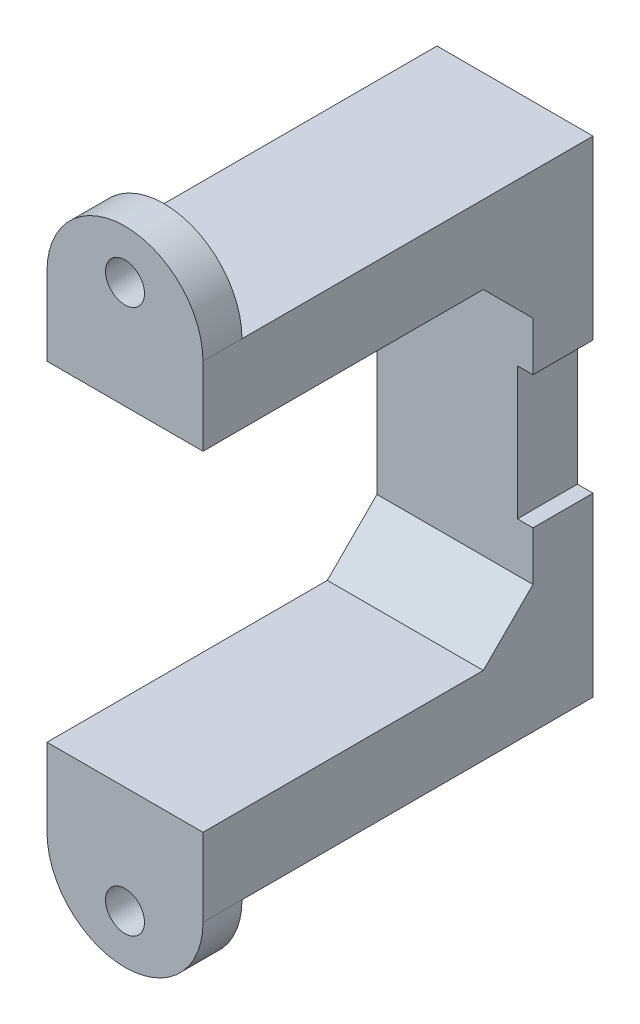
ISO-10303-21;
HEADER;
FILE_DESCRIPTION(('STEP AP214'),'2;1');
FILE_NAME('part.step','',(''),(''),'','','');
FILE_SCHEMA(('AUTOMOTIVE_DESIGN { 1 0 10303 214 1 1 1 1 }'));
ENDSEC;
DATA;
#1=APPLICATION_CONTEXT('core data for automotive mechanical design processes');
#2=APPLICATION_PROTOCOL_DEFINITION('international standard','automotive_design',2000,#1);
#3=PRODUCT_CONTEXT('',#1,'mechanical');
#4=PRODUCT('Part','Part','',(#3));
#5=PRODUCT_RELATED_PRODUCT_CATEGORY('part','',(#4));
#6=PRODUCT_DEFINITION_FORMATION('','',#4);
#7=PRODUCT_DEFINITION_CONTEXT('part definition',#1,'design');
#8=PRODUCT_DEFINITION('design','',#6,#7);
#9=PRODUCT_DEFINITION_SHAPE('','',#8);
#10=(LENGTH_UNIT() NAMED_UNIT(*) SI_UNIT(.MILLI.,.METRE.));
#11=(NAMED_UNIT(*) PLANE_ANGLE_UNIT() SI_UNIT($,.RADIAN.));
#12=(NAMED_UNIT(*) SI_UNIT($,.STERADIAN.) SOLID_ANGLE_UNIT());
#13=UNCERTAINTY_MEASURE_WITH_UNIT(LENGTH_MEASURE(1.E-05),#10,'distance_accuracy_value','');
#14=(GEOMETRIC_REPRESENTATION_CONTEXT(3) GLOBAL_UNCERTAINTY_ASSIGNED_CONTEXT((#13)) GLOBAL_UNIT_ASSIGNED_CONTEXT((#10,
#11,#12)) REPRESENTATION_CONTEXT('',''));
#15=CARTESIAN_POINT('',(0.,0.,0.));
#16=DIRECTION('',(0.,0.,1.));
#17=DIRECTION('',(1.,0.,0.));
#18=AXIS2_PLACEMENT_3D('',#15,#16,#17);
#19=CARTESIAN_POINT('',(0.,62.3,0.));
#20=DIRECTION('',(-1.,0.,0.));
#21=DIRECTION('',(0.,0.,1.));
#22=AXIS2_PLACEMENT_3D('',#19,#20,#21);
#23=PLANE('',#22);
#24=DIRECTION('',(0.,1.,0.));
#25=VECTOR('',#24,1.);
#26=CARTESIAN_POINT('',(0.,62.3,-42.3));
#27=LINE('',#26,#25);
#28=CARTESIAN_POINT('',(0.,39.65,-42.3));
#29=VERTEX_POINT('',#28);
#30=CARTESIAN_POINT('',(0.,45.936038969321,-42.3));
#31=VERTEX_POINT('',#30);
#32=EDGE_CURVE('E192',#29,#31,#27,.T.);
#33=ORIENTED_EDGE('',*,*,#32,.F.);
#34=DIRECTION('',(0.,0.,-1.));
#35=VECTOR('',#34,1.);
#36=CARTESIAN_POINT('',(0.,39.65,-40.));
#37=LINE('',#36,#35);
#38=CARTESIAN_POINT('',(0.,39.65,-50.));
#39=VERTEX_POINT('',#38);
#40=EDGE_CURVE('E352',#29,#39,#37,.T.);
#41=ORIENTED_EDGE('',*,*,#40,.T.);
#42=DIRECTION('',(0.,-1.,0.));
#43=VECTOR('',#42,1.);
#44=CARTESIAN_POINT('',(0.,62.3,-50.));
#45=LINE('',#44,#43);
#46=CARTESIAN_POINT('',(0.,62.3,-50.));
#47=VERTEX_POINT('',#46);
#48=EDGE_CURVE('E171',#47,#39,#45,.T.);
#49=ORIENTED_EDGE('',*,*,#48,.F.);
#50=DIRECTION('',(0.,0.,-1.));
#51=VECTOR('',#50,1.);
#52=CARTESIAN_POINT('',(0.,62.3,0.));
#53=LINE('',#52,#51);
#54=CARTESIAN_POINT('',(0.,62.3,-5.));
#55=VERTEX_POINT('',#54);
#56=EDGE_CURVE('E239',#55,#47,#53,.T.);
#57=ORIENTED_EDGE('',*,*,#56,.F.);
#58=CARTESIAN_POINT('',(0.,62.3,0.));
#59=VERTEX_POINT('',#58);
#60=EDGE_CURVE('E241',#59,#55,#53,.T.);
#61=ORIENTED_EDGE('',*,*,#60,.F.);
#62=DIRECTION('',(0.,-1.,0.));
#63=VECTOR('',#62,1.);
#64=CARTESIAN_POINT('',(0.,62.3,0.));
#65=LINE('',#64,#63);
#66=CARTESIAN_POINT('',(0.,52.3,0.));
#67=VERTEX_POINT('',#66);
#68=EDGE_CURVE('E180',#59,#67,#65,.T.);
#69=ORIENTED_EDGE('',*,*,#68,.T.);
#70=DIRECTION('',(0.,0.,1.));
#71=VECTOR('',#70,1.);
#72=CARTESIAN_POINT('',(0.,52.3,0.));
#73=LINE('',#72,#71);
#74=CARTESIAN_POINT('',(0.,52.3,-35.9360389693211));
#75=VERTEX_POINT('',#74);
#76=EDGE_CURVE('E198',#75,#67,#73,.T.);
#77=ORIENTED_EDGE('',*,*,#76,.F.);
#78=DIRECTION('',(0.,-0.707106781186551,-0.707106781186544));
#79=VECTOR('',#78,1.);
#80=CARTESIAN_POINT('',(0.,75.2680194846606,-12.9680194846607));
#81=LINE('',#80,#79);
#82=EDGE_CURVE('E195',#75,#31,#81,.T.);
#83=ORIENTED_EDGE('',*,*,#82,.T.);
#84=EDGE_LOOP('',(#33,#41,#49,#57,#61,#69,#77,#83));
#85=FACE_BOUND('',#84,.T.);
#86=ADVANCED_FACE('F33',(#85),#23,.F.);
#87=CARTESIAN_POINT('',(0.,62.3,0.));
#88=DIRECTION('',(0.,1.,0.));
#89=DIRECTION('',(0.,0.,1.));
#90=AXIS2_PLACEMENT_3D('',#87,#88,#89);
#91=PLANE('',#90);
#92=DIRECTION('',(0.,0.,1.));
#93=VECTOR('',#92,1.);
#94=CARTESIAN_POINT('',(-20.,62.3,0.));
#95=LINE('',#94,#93);
#96=CARTESIAN_POINT('',(-20.,62.3,-50.));
#97=VERTEX_POINT('',#96);
#98=CARTESIAN_POINT('',(-20.,62.3,-5.));
#99=VERTEX_POINT('',#98);
#100=EDGE_CURVE('E237',#97,#99,#95,.T.);
#101=ORIENTED_EDGE('',*,*,#100,.T.);
#102=DIRECTION('',(1.,0.,0.));
#103=VECTOR('',#102,1.);
#104=CARTESIAN_POINT('',(-20.,62.3,-5.));
#105=LINE('',#104,#103);
#106=EDGE_CURVE('E56',#99,#55,#105,.T.);
#107=ORIENTED_EDGE('',*,*,#106,.T.);
#108=ORIENTED_EDGE('',*,*,#56,.T.);
#109=DIRECTION('',(-1.,0.,0.));
#110=VECTOR('',#109,1.);
#111=CARTESIAN_POINT('',(0.,62.3,-50.));
#112=LINE('',#111,#110);
#113=EDGE_CURVE('E176',#47,#97,#112,.T.);
#114=ORIENTED_EDGE('',*,*,#113,.T.);
#115=EDGE_LOOP('',(#101,#107,#108,#114));
#116=FACE_BOUND('',#115,.T.);
#117=ADVANCED_FACE('F321',(#116),#91,.T.);
#118=CARTESIAN_POINT('',(-20.,62.3,0.));
#119=DIRECTION('',(1.,0.,0.));
#120=DIRECTION('',(0.,0.,-1.));
#121=AXIS2_PLACEMENT_3D('',#118,#119,#120);
#122=PLANE('',#121);
#123=DIRECTION('',(0.,0.,-1.));
#124=VECTOR('',#123,1.);
#125=CARTESIAN_POINT('',(-20.,52.3,0.));
#126=LINE('',#125,#124);
#127=CARTESIAN_POINT('',(-20.,52.3,0.));
#128=VERTEX_POINT('',#127);
#129=CARTESIAN_POINT('',(-20.,52.3,-35.9360389693211));
#130=VERTEX_POINT('',#129);
#131=EDGE_CURVE('E282',#128,#130,#126,.T.);
#132=ORIENTED_EDGE('',*,*,#131,.F.);
#133=DIRECTION('',(0.,-1.,0.));
#134=VECTOR('',#133,1.);
#135=CARTESIAN_POINT('',(-20.,62.3,0.));
#136=LINE('',#135,#134);
#137=CARTESIAN_POINT('',(-20.,62.3,0.));
#138=VERTEX_POINT('',#137);
#139=EDGE_CURVE('E184',#138,#128,#136,.T.);
#140=ORIENTED_EDGE('',*,*,#139,.F.);
#141=DIRECTION('',(0.,0.,1.));
#142=VECTOR('',#141,1.);
#143=CARTESIAN_POINT('',(-20.,62.3,-5.));
#144=LINE('',#143,#142);
#145=EDGE_CURVE('E277',#99,#138,#144,.T.);
#146=ORIENTED_EDGE('',*,*,#145,.F.);
#147=ORIENTED_EDGE('',*,*,#100,.F.);
#148=DIRECTION('',(0.,-1.,0.));
#149=VECTOR('',#148,1.);
#150=CARTESIAN_POINT('',(-20.,62.3,-50.));
#151=LINE('',#150,#149);
#152=CARTESIAN_POINT('',(-20.,0.,-50.));
#153=VERTEX_POINT('',#152);
#154=EDGE_CURVE('E172',#97,#153,#151,.T.);
#155=ORIENTED_EDGE('',*,*,#154,.T.);
#156=DIRECTION('',(0.,0.,1.));
#157=VECTOR('',#156,1.);
#158=CARTESIAN_POINT('',(-20.,0.,0.));
#159=LINE('',#158,#157);
#160=CARTESIAN_POINT('',(-20.,0.,-5.));
#161=VERTEX_POINT('',#160);
#162=EDGE_CURVE('E236',#153,#161,#159,.T.);
#163=ORIENTED_EDGE('',*,*,#162,.T.);
#164=DIRECTION('',(0.,0.,1.));
#165=VECTOR('',#164,1.);
#166=CARTESIAN_POINT('',(-20.,0.,-5.));
#167=LINE('',#166,#165);
#168=CARTESIAN_POINT('',(-20.,0.,0.));
#169=VERTEX_POINT('',#168);
#170=EDGE_CURVE('E262',#161,#169,#167,.T.);
#171=ORIENTED_EDGE('',*,*,#170,.T.);
#172=CARTESIAN_POINT('',(-20.,9.99999999999999,0.));
#173=VERTEX_POINT('',#172);
#174=EDGE_CURVE('E183',#173,#169,#136,.T.);
#175=ORIENTED_EDGE('',*,*,#174,.F.);
#176=DIRECTION('',(0.,0.,-1.));
#177=VECTOR('',#176,1.);
#178=CARTESIAN_POINT('',(-20.,9.99999999999999,0.));
#179=LINE('',#178,#177);
#180=CARTESIAN_POINT('',(-20.,9.99999999999999,-35.936038969321));
#181=VERTEX_POINT('',#180);
#182=EDGE_CURVE('E290',#173,#181,#179,.T.);
#183=ORIENTED_EDGE('',*,*,#182,.T.);
#184=DIRECTION('',(0.,-0.707106781186544,0.707106781186551));
#185=VECTOR('',#184,1.);
#186=CARTESIAN_POINT('',(-20.,16.3639610306789,-42.3));
#187=LINE('',#186,#185);
#188=CARTESIAN_POINT('',(-20.,16.3639610306789,-42.3));
#189=VERTEX_POINT('',#188);
#190=EDGE_CURVE('E220',#189,#181,#187,.T.);
#191=ORIENTED_EDGE('',*,*,#190,.F.);
#192=DIRECTION('',(0.,-1.,0.));
#193=VECTOR('',#192,1.);
#194=CARTESIAN_POINT('',(-20.,45.936038969321,-42.3));
#195=LINE('',#194,#193);
#196=CARTESIAN_POINT('',(-20.,45.936038969321,-42.3));
#197=VERTEX_POINT('',#196);
#198=EDGE_CURVE('E287',#197,#189,#195,.T.);
#199=ORIENTED_EDGE('',*,*,#198,.F.);
#200=DIRECTION('',(0.,0.707106781186551,0.707106781186544));
#201=VECTOR('',#200,1.);
#202=CARTESIAN_POINT('',(-20.,45.936038969321,-42.3));
#203=LINE('',#202,#201);
#204=EDGE_CURVE('E284',#197,#130,#203,.T.);
#205=ORIENTED_EDGE('',*,*,#204,.T.);
#206=EDGE_LOOP('',(#132,#140,#146,#147,#155,#163,#171,#175,#183,#191,#199,#205));
#207=FACE_BOUND('',#206,.T.);
#208=ADVANCED_FACE('F35',(#207),#122,.F.);
#209=CARTESIAN_POINT('',(-20.,62.3,0.));
#210=DIRECTION('',(0.,0.,-1.));
#211=DIRECTION('',(-1.,0.,0.));
#212=AXIS2_PLACEMENT_3D('',#209,#210,#211);
#213=PLANE('',#212);
#214=CARTESIAN_POINT('',(-10.,66.05,0.));
#215=DIRECTION('',(0.,0.,-1.));
#216=DIRECTION('',(-1.,0.,0.));
#217=AXIS2_PLACEMENT_3D('',#214,#215,#216);
#218=CIRCLE('',#217,2.5);
#219=CARTESIAN_POINT('',(-12.5,66.05,0.));
#220=VERTEX_POINT('',#219);
#221=EDGE_CURVE('E271',#220,#220,#218,.T.);
#222=ORIENTED_EDGE('',*,*,#221,.T.);
#223=EDGE_LOOP('',(#222));
#224=FACE_BOUND('',#223,.T.);
#225=DIRECTION('',(1.,0.,0.));
#226=VECTOR('',#225,1.);
#227=CARTESIAN_POINT('',(-20.,52.3,0.));
#228=LINE('',#227,#226);
#229=EDGE_CURVE('E227',#128,#67,#228,.T.);
#230=ORIENTED_EDGE('',*,*,#229,.T.);
#231=ORIENTED_EDGE('',*,*,#68,.F.);
#232=CARTESIAN_POINT('',(-10.,62.3,0.));
#233=DIRECTION('',(0.,0.,1.));
#234=DIRECTION('',(1.,0.,0.));
#235=AXIS2_PLACEMENT_3D('',#232,#233,#234);
#236=CIRCLE('',#235,10.);
#237=EDGE_CURVE('E265',#59,#138,#236,.T.);
#238=ORIENTED_EDGE('',*,*,#237,.T.);
#239=ORIENTED_EDGE('',*,*,#139,.T.);
#240=EDGE_LOOP('',(#230,#231,#238,#239));
#241=FACE_BOUND('',#240,.T.);
#242=ADVANCED_FACE('F294',(#224,#241),#213,.F.);
#243=CARTESIAN_POINT('',(0.,22.65,-50.));
#244=VERTEX_POINT('',#243);
#245=CARTESIAN_POINT('',(0.,0.,-50.));
#246=VERTEX_POINT('',#245);
#247=EDGE_CURVE('E160',#244,#246,#45,.T.);
#248=ORIENTED_EDGE('',*,*,#247,.F.);
#249=DIRECTION('',(0.,0.,-1.));
#250=VECTOR('',#249,1.);
#251=CARTESIAN_POINT('',(0.,22.65,-40.));
#252=LINE('',#251,#250);
#253=CARTESIAN_POINT('',(0.,22.65,-42.3));
#254=VERTEX_POINT('',#253);
#255=EDGE_CURVE('E144',#254,#244,#252,.T.);
#256=ORIENTED_EDGE('',*,*,#255,.F.);
#257=CARTESIAN_POINT('',(0.,16.3639610306789,-42.3));
#258=VERTEX_POINT('',#257);
#259=EDGE_CURVE('E193',#258,#254,#27,.T.);
#260=ORIENTED_EDGE('',*,*,#259,.F.);
#261=DIRECTION('',(0.,0.707106781186544,-0.707106781186551));
#262=VECTOR('',#261,1.);
#263=CARTESIAN_POINT('',(0.,18.1819805153392,-44.1180194846603));
#264=LINE('',#263,#262);
#265=CARTESIAN_POINT('',(0.,9.99999999999999,-35.936038969321));
#266=VERTEX_POINT('',#265);
#267=EDGE_CURVE('E190',#266,#258,#264,.T.);
#268=ORIENTED_EDGE('',*,*,#267,.F.);
#269=DIRECTION('',(0.,0.,1.));
#270=VECTOR('',#269,1.);
#271=CARTESIAN_POINT('',(0.,9.99999999999999,0.));
#272=LINE('',#271,#270);
#273=CARTESIAN_POINT('',(0.,9.99999999999999,0.));
#274=VERTEX_POINT('',#273);
#275=EDGE_CURVE('E187',#266,#274,#272,.T.);
#276=ORIENTED_EDGE('',*,*,#275,.T.);
#277=CARTESIAN_POINT('',(0.,0.,0.));
#278=VERTEX_POINT('',#277);
#279=EDGE_CURVE('E174',#274,#278,#65,.T.);
#280=ORIENTED_EDGE('',*,*,#279,.T.);
#281=DIRECTION('',(0.,0.,-1.));
#282=VECTOR('',#281,1.);
#283=CARTESIAN_POINT('',(0.,0.,0.));
#284=LINE('',#283,#282);
#285=CARTESIAN_POINT('',(0.,0.,-5.));
#286=VERTEX_POINT('',#285);
#287=EDGE_CURVE('E247',#278,#286,#284,.T.);
#288=ORIENTED_EDGE('',*,*,#287,.T.);
#289=EDGE_CURVE('E169',#286,#246,#284,.T.);
#290=ORIENTED_EDGE('',*,*,#289,.T.);
#291=EDGE_LOOP('',(#248,#256,#260,#268,#276,#280,#288,#290));
#292=FACE_BOUND('',#291,.T.);
#293=ADVANCED_FACE('F166',(#292),#23,.F.);
#294=CARTESIAN_POINT('',(-10.,-3.75,0.));
#295=DIRECTION('',(0.,0.,-1.));
#296=DIRECTION('',(1.,0.,0.));
#297=AXIS2_PLACEMENT_3D('',#294,#295,#296);
#298=CIRCLE('',#297,2.5);
#299=CARTESIAN_POINT('',(-7.5,-3.75,0.));
#300=VERTEX_POINT('',#299);
#301=EDGE_CURVE('E345',#300,#300,#298,.T.);
#302=ORIENTED_EDGE('',*,*,#301,.T.);
#303=EDGE_LOOP('',(#302));
#304=FACE_BOUND('',#303,.T.);
#305=ORIENTED_EDGE('',*,*,#279,.F.);
#306=DIRECTION('',(1.,0.,0.));
#307=VECTOR('',#306,1.);
#308=CARTESIAN_POINT('',(-20.,9.99999999999999,0.));
#309=LINE('',#308,#307);
#310=EDGE_CURVE('E223',#173,#274,#309,.T.);
#311=ORIENTED_EDGE('',*,*,#310,.F.);
#312=ORIENTED_EDGE('',*,*,#174,.T.);
#313=CARTESIAN_POINT('',(-10.,0.,0.));
#314=DIRECTION('',(0.,0.,1.));
#315=DIRECTION('',(-1.,0.,0.));
#316=AXIS2_PLACEMENT_3D('',#313,#314,#315);
#317=CIRCLE('',#316,10.);
#318=EDGE_CURVE('E267',#169,#278,#317,.T.);
#319=ORIENTED_EDGE('',*,*,#318,.T.);
#320=EDGE_LOOP('',(#305,#311,#312,#319));
#321=FACE_BOUND('',#320,.T.);
#322=ADVANCED_FACE('F329',(#304,#321),#213,.F.);
#323=CARTESIAN_POINT('',(0.,62.3,-50.));
#324=DIRECTION('',(0.,0.,1.));
#325=DIRECTION('',(1.,0.,0.));
#326=AXIS2_PLACEMENT_3D('',#323,#324,#325);
#327=PLANE('',#326);
#328=ORIENTED_EDGE('',*,*,#48,.T.);
#329=DIRECTION('',(1.,0.,0.));
#330=VECTOR('',#329,1.);
#331=CARTESIAN_POINT('',(0.,39.65,-50.));
#332=LINE('',#331,#330);
#333=CARTESIAN_POINT('',(-2.00000000000001,39.65,-50.));
#334=VERTEX_POINT('',#333);
#335=EDGE_CURVE('E155',#334,#39,#332,.T.);
#336=ORIENTED_EDGE('',*,*,#335,.F.);
#337=DIRECTION('',(0.,1.,0.));
#338=VECTOR('',#337,1.);
#339=CARTESIAN_POINT('',(-2.00000000000001,22.65,-50.));
#340=LINE('',#339,#338);
#341=CARTESIAN_POINT('',(-2.00000000000001,22.65,-50.));
#342=VERTEX_POINT('',#341);
#343=EDGE_CURVE('E164',#342,#334,#340,.T.);
#344=ORIENTED_EDGE('',*,*,#343,.F.);
#345=DIRECTION('',(-1.,0.,0.));
#346=VECTOR('',#345,1.);
#347=CARTESIAN_POINT('',(0.,22.65,-50.));
#348=LINE('',#347,#346);
#349=EDGE_CURVE('E147',#244,#342,#348,.T.);
#350=ORIENTED_EDGE('',*,*,#349,.F.);
#351=ORIENTED_EDGE('',*,*,#247,.T.);
#352=DIRECTION('',(-1.,0.,0.));
#353=VECTOR('',#352,1.);
#354=CARTESIAN_POINT('',(0.,0.,-50.));
#355=LINE('',#354,#353);
#356=EDGE_CURVE('E240',#246,#153,#355,.T.);
#357=ORIENTED_EDGE('',*,*,#356,.T.);
#358=ORIENTED_EDGE('',*,*,#154,.F.);
#359=ORIENTED_EDGE('',*,*,#113,.F.);
#360=EDGE_LOOP('',(#328,#336,#344,#350,#351,#357,#358,#359));
#361=FACE_BOUND('',#360,.T.);
#362=ADVANCED_FACE('F159',(#361),#327,.F.);
#363=CARTESIAN_POINT('',(0.,0.,0.));
#364=DIRECTION('',(0.,1.,0.));
#365=DIRECTION('',(0.,0.,1.));
#366=AXIS2_PLACEMENT_3D('',#363,#364,#365);
#367=PLANE('',#366);
#368=ORIENTED_EDGE('',*,*,#289,.F.);
#369=DIRECTION('',(-1.,0.,0.));
#370=VECTOR('',#369,1.);
#371=CARTESIAN_POINT('',(-20.,0.,-5.));
#372=LINE('',#371,#370);
#373=EDGE_CURVE('E259',#286,#161,#372,.T.);
#374=ORIENTED_EDGE('',*,*,#373,.T.);
#375=ORIENTED_EDGE('',*,*,#162,.F.);
#376=ORIENTED_EDGE('',*,*,#356,.F.);
#377=EDGE_LOOP('',(#368,#374,#375,#376));
#378=FACE_BOUND('',#377,.T.);
#379=ADVANCED_FACE('F257',(#378),#367,.F.);
#380=CARTESIAN_POINT('',(-20.,52.3,0.));
#381=DIRECTION('',(0.,-1.,0.));
#382=DIRECTION('',(0.,0.,-1.));
#383=AXIS2_PLACEMENT_3D('',#380,#381,#382);
#384=PLANE('',#383);
#385=ORIENTED_EDGE('',*,*,#76,.T.);
#386=ORIENTED_EDGE('',*,*,#229,.F.);
#387=ORIENTED_EDGE('',*,*,#131,.T.);
#388=DIRECTION('',(1.,0.,0.));
#389=VECTOR('',#388,1.);
#390=CARTESIAN_POINT('',(-20.,52.3,-35.9360389693211));
#391=LINE('',#390,#389);
#392=EDGE_CURVE('E233',#130,#75,#391,.T.);
#393=ORIENTED_EDGE('',*,*,#392,.T.);
#394=EDGE_LOOP('',(#385,#386,#387,#393));
#395=FACE_BOUND('',#394,.T.);
#396=ADVANCED_FACE('F366',(#395),#384,.T.);
#397=CARTESIAN_POINT('',(-20.,45.936038969321,-42.3));
#398=DIRECTION('',(0.,0.707106781186544,-0.707106781186551));
#399=DIRECTION('',(0.,0.707106781186551,0.707106781186544));
#400=AXIS2_PLACEMENT_3D('',#397,#398,#399);
#401=PLANE('',#400);
#402=ORIENTED_EDGE('',*,*,#392,.F.);
#403=ORIENTED_EDGE('',*,*,#204,.F.);
#404=DIRECTION('',(1.,0.,0.));
#405=VECTOR('',#404,1.);
#406=CARTESIAN_POINT('',(-20.,45.936038969321,-42.3));
#407=LINE('',#406,#405);
#408=EDGE_CURVE('E225',#197,#31,#407,.T.);
#409=ORIENTED_EDGE('',*,*,#408,.T.);
#410=ORIENTED_EDGE('',*,*,#82,.F.);
#411=EDGE_LOOP('',(#402,#403,#409,#410));
#412=FACE_BOUND('',#411,.T.);
#413=ADVANCED_FACE('F364',(#412),#401,.F.);
#414=CARTESIAN_POINT('',(-20.,45.936038969321,-42.3));
#415=DIRECTION('',(0.,0.,1.));
#416=DIRECTION('',(0.,-1.,0.));
#417=AXIS2_PLACEMENT_3D('',#414,#415,#416);
#418=PLANE('',#417);
#419=DIRECTION('',(-1.,0.,0.));
#420=VECTOR('',#419,1.);
#421=CARTESIAN_POINT('',(-20.,39.65,-42.3));
#422=LINE('',#421,#420);
#423=CARTESIAN_POINT('',(-2.00000000000001,39.65,-42.3));
#424=VERTEX_POINT('',#423);
#425=EDGE_CURVE('E11',#29,#424,#422,.T.);
#426=ORIENTED_EDGE('',*,*,#425,.F.);
#427=ORIENTED_EDGE('',*,*,#32,.T.);
#428=ORIENTED_EDGE('',*,*,#408,.F.);
#429=ORIENTED_EDGE('',*,*,#198,.T.);
#430=DIRECTION('',(1.,0.,0.));
#431=VECTOR('',#430,1.);
#432=CARTESIAN_POINT('',(-20.,16.3639610306789,-42.3));
#433=LINE('',#432,#431);
#434=EDGE_CURVE('E210',#189,#258,#433,.T.);
#435=ORIENTED_EDGE('',*,*,#434,.T.);
#436=ORIENTED_EDGE('',*,*,#259,.T.);
#437=DIRECTION('',(1.,0.,0.));
#438=VECTOR('',#437,1.);
#439=CARTESIAN_POINT('',(-20.,22.65,-42.3));
#440=LINE('',#439,#438);
#441=CARTESIAN_POINT('',(-2.00000000000001,22.65,-42.3));
#442=VERTEX_POINT('',#441);
#443=EDGE_CURVE('E150',#442,#254,#440,.T.);
#444=ORIENTED_EDGE('',*,*,#443,.F.);
#445=DIRECTION('',(0.,-1.,0.));
#446=VECTOR('',#445,1.);
#447=CARTESIAN_POINT('',(-2.00000000000001,45.936038969321,-42.3));
#448=LINE('',#447,#446);
#449=EDGE_CURVE('E41',#424,#442,#448,.T.);
#450=ORIENTED_EDGE('',*,*,#449,.F.);
#451=EDGE_LOOP('',(#426,#427,#428,#429,#435,#436,#444,#450));
#452=FACE_BOUND('',#451,.T.);
#453=ADVANCED_FACE('F207',(#452),#418,.T.);
#454=CARTESIAN_POINT('',(-20.,16.3639610306789,-42.3));
#455=DIRECTION('',(0.,0.707106781186551,0.707106781186544));
#456=DIRECTION('',(0.,-0.707106781186544,0.707106781186551));
#457=AXIS2_PLACEMENT_3D('',#454,#455,#456);
#458=PLANE('',#457);
#459=ORIENTED_EDGE('',*,*,#267,.T.);
#460=ORIENTED_EDGE('',*,*,#434,.F.);
#461=ORIENTED_EDGE('',*,*,#190,.T.);
#462=DIRECTION('',(1.,0.,0.));
#463=VECTOR('',#462,1.);
#464=CARTESIAN_POINT('',(-20.,9.99999999999999,-35.936038969321));
#465=LINE('',#464,#463);
#466=EDGE_CURVE('E219',#181,#266,#465,.T.);
#467=ORIENTED_EDGE('',*,*,#466,.T.);
#468=EDGE_LOOP('',(#459,#460,#461,#467));
#469=FACE_BOUND('',#468,.T.);
#470=ADVANCED_FACE('F216',(#469),#458,.T.);
#471=CARTESIAN_POINT('',(-20.,9.99999999999999,0.));
#472=DIRECTION('',(0.,-1.,0.));
#473=DIRECTION('',(0.,0.,-1.));
#474=AXIS2_PLACEMENT_3D('',#471,#472,#473);
#475=PLANE('',#474);
#476=ORIENTED_EDGE('',*,*,#466,.F.);
#477=ORIENTED_EDGE('',*,*,#182,.F.);
#478=ORIENTED_EDGE('',*,*,#310,.T.);
#479=ORIENTED_EDGE('',*,*,#275,.F.);
#480=EDGE_LOOP('',(#476,#477,#478,#479));
#481=FACE_BOUND('',#480,.T.);
#482=ADVANCED_FACE('F317',(#481),#475,.F.);
#483=CARTESIAN_POINT('',(-10.,62.3,-5.));
#484=DIRECTION('',(0.,0.,1.));
#485=DIRECTION('',(1.,0.,0.));
#486=AXIS2_PLACEMENT_3D('',#483,#484,#485);
#487=CYLINDRICAL_SURFACE('',#486,10.);
#488=ORIENTED_EDGE('',*,*,#237,.F.);
#489=ORIENTED_EDGE('',*,*,#60,.T.);
#490=CARTESIAN_POINT('',(-10.,62.3,-5.));
#491=DIRECTION('',(0.,0.,1.));
#492=DIRECTION('',(1.,0.,0.));
#493=AXIS2_PLACEMENT_3D('',#490,#491,#492);
#494=CIRCLE('',#493,10.);
#495=EDGE_CURVE('E273',#55,#99,#494,.T.);
#496=ORIENTED_EDGE('',*,*,#495,.T.);
#497=ORIENTED_EDGE('',*,*,#145,.T.);
#498=EDGE_LOOP('',(#488,#489,#496,#497));
#499=FACE_BOUND('',#498,.T.);
#500=ADVANCED_FACE('F303',(#499),#487,.T.);
#501=CARTESIAN_POINT('',(-10.,62.3,-5.));
#502=DIRECTION('',(0.,0.,1.));
#503=DIRECTION('',(1.,0.,0.));
#504=AXIS2_PLACEMENT_3D('',#501,#502,#503);
#505=PLANE('',#504);
#506=CARTESIAN_POINT('',(-10.,66.05,-5.));
#507=DIRECTION('',(0.,0.,-1.));
#508=DIRECTION('',(-1.,0.,0.));
#509=AXIS2_PLACEMENT_3D('',#506,#507,#508);
#510=CIRCLE('',#509,2.5);
#511=CARTESIAN_POINT('',(-12.5,66.05,-5.));
#512=VERTEX_POINT('',#511);
#513=EDGE_CURVE('E342',#512,#512,#510,.T.);
#514=ORIENTED_EDGE('',*,*,#513,.F.);
#515=EDGE_LOOP('',(#514));
#516=FACE_BOUND('',#515,.T.);
#517=ORIENTED_EDGE('',*,*,#495,.F.);
#518=ORIENTED_EDGE('',*,*,#106,.F.);
#519=EDGE_LOOP('',(#517,#518));
#520=FACE_BOUND('',#519,.T.);
#521=ADVANCED_FACE('F305',(#516,#520),#505,.F.);
#522=CARTESIAN_POINT('',(-10.,0.,-5.));
#523=DIRECTION('',(0.,0.,1.));
#524=DIRECTION('',(1.,0.,0.));
#525=AXIS2_PLACEMENT_3D('',#522,#523,#524);
#526=CYLINDRICAL_SURFACE('',#525,10.);
#527=ORIENTED_EDGE('',*,*,#318,.F.);
#528=ORIENTED_EDGE('',*,*,#170,.F.);
#529=CARTESIAN_POINT('',(-10.,0.,-5.));
#530=DIRECTION('',(0.,0.,1.));
#531=DIRECTION('',(-1.,0.,0.));
#532=AXIS2_PLACEMENT_3D('',#529,#530,#531);
#533=CIRCLE('',#532,10.);
#534=EDGE_CURVE('E263',#161,#286,#533,.T.);
#535=ORIENTED_EDGE('',*,*,#534,.T.);
#536=ORIENTED_EDGE('',*,*,#287,.F.);
#537=EDGE_LOOP('',(#527,#528,#535,#536));
#538=FACE_BOUND('',#537,.T.);
#539=ADVANCED_FACE('F307',(#538),#526,.T.);
#540=CARTESIAN_POINT('',(-10.,0.,-5.));
#541=DIRECTION('',(0.,0.,-1.));
#542=DIRECTION('',(-1.,0.,0.));
#543=AXIS2_PLACEMENT_3D('',#540,#541,#542);
#544=PLANE('',#543);
#545=CARTESIAN_POINT('',(-10.,-3.75,-5.));
#546=DIRECTION('',(0.,0.,-1.));
#547=DIRECTION('',(1.,0.,0.));
#548=AXIS2_PLACEMENT_3D('',#545,#546,#547);
#549=CIRCLE('',#548,2.5);
#550=CARTESIAN_POINT('',(-7.5,-3.75,-5.));
#551=VERTEX_POINT('',#550);
#552=EDGE_CURVE('E350',#551,#551,#549,.T.);
#553=ORIENTED_EDGE('',*,*,#552,.F.);
#554=EDGE_LOOP('',(#553));
#555=FACE_BOUND('',#554,.T.);
#556=ORIENTED_EDGE('',*,*,#534,.F.);
#557=ORIENTED_EDGE('',*,*,#373,.F.);
#558=EDGE_LOOP('',(#556,#557));
#559=FACE_BOUND('',#558,.T.);
#560=ADVANCED_FACE('F314',(#555,#559),#544,.T.);
#561=CARTESIAN_POINT('',(-10.,-3.75,0.));
#562=DIRECTION('',(0.,0.,-1.));
#563=DIRECTION('',(-1.,0.,0.));
#564=AXIS2_PLACEMENT_3D('',#561,#562,#563);
#565=CYLINDRICAL_SURFACE('',#564,2.5);
#566=ORIENTED_EDGE('',*,*,#301,.F.);
#567=EDGE_LOOP('',(#566));
#568=FACE_BOUND('',#567,.T.);
#569=ORIENTED_EDGE('',*,*,#552,.T.);
#570=EDGE_LOOP('',(#569));
#571=FACE_BOUND('',#570,.T.);
#572=ADVANCED_FACE('F374',(#568,#571),#565,.F.);
#573=CARTESIAN_POINT('',(-10.,66.05,0.));
#574=DIRECTION('',(0.,0.,-1.));
#575=DIRECTION('',(-1.,0.,0.));
#576=AXIS2_PLACEMENT_3D('',#573,#574,#575);
#577=CYLINDRICAL_SURFACE('',#576,2.5);
#578=ORIENTED_EDGE('',*,*,#221,.F.);
#579=EDGE_LOOP('',(#578));
#580=FACE_BOUND('',#579,.T.);
#581=ORIENTED_EDGE('',*,*,#513,.T.);
#582=EDGE_LOOP('',(#581));
#583=FACE_BOUND('',#582,.T.);
#584=ADVANCED_FACE('F380',(#580,#583),#577,.F.);
#585=CARTESIAN_POINT('',(0.,39.65,-40.));
#586=DIRECTION('',(0.,1.,0.));
#587=DIRECTION('',(0.,0.,1.));
#588=AXIS2_PLACEMENT_3D('',#585,#586,#587);
#589=PLANE('',#588);
#590=ORIENTED_EDGE('',*,*,#425,.T.);
#591=DIRECTION('',(0.,0.,-1.));
#592=VECTOR('',#591,1.);
#593=CARTESIAN_POINT('',(-2.00000000000001,39.65,-40.));
#594=LINE('',#593,#592);
#595=EDGE_CURVE('E204',#424,#334,#594,.T.);
#596=ORIENTED_EDGE('',*,*,#595,.T.);
#597=ORIENTED_EDGE('',*,*,#335,.T.);
#598=ORIENTED_EDGE('',*,*,#40,.F.);
#599=EDGE_LOOP('',(#590,#596,#597,#598));
#600=FACE_BOUND('',#599,.T.);
#601=ADVANCED_FACE('F361',(#600),#589,.F.);
#602=CARTESIAN_POINT('',(-2.00000000000001,22.65,-40.));
#603=DIRECTION('',(-1.,0.,0.));
#604=DIRECTION('',(0.,0.,1.));
#605=AXIS2_PLACEMENT_3D('',#602,#603,#604);
#606=PLANE('',#605);
#607=ORIENTED_EDGE('',*,*,#449,.T.);
#608=DIRECTION('',(0.,0.,-1.));
#609=VECTOR('',#608,1.);
#610=CARTESIAN_POINT('',(-2.00000000000001,22.65,-40.));
#611=LINE('',#610,#609);
#612=EDGE_CURVE('E48',#442,#342,#611,.T.);
#613=ORIENTED_EDGE('',*,*,#612,.T.);
#614=ORIENTED_EDGE('',*,*,#343,.T.);
#615=ORIENTED_EDGE('',*,*,#595,.F.);
#616=EDGE_LOOP('',(#607,#613,#614,#615));
#617=FACE_BOUND('',#616,.T.);
#618=ADVANCED_FACE('F203',(#617),#606,.F.);
#619=CARTESIAN_POINT('',(0.,22.65,-40.));
#620=DIRECTION('',(0.,-1.,0.));
#621=DIRECTION('',(0.,0.,-1.));
#622=AXIS2_PLACEMENT_3D('',#619,#620,#621);
#623=PLANE('',#622);
#624=ORIENTED_EDGE('',*,*,#443,.T.);
#625=ORIENTED_EDGE('',*,*,#255,.T.);
#626=ORIENTED_EDGE('',*,*,#349,.T.);
#627=ORIENTED_EDGE('',*,*,#612,.F.);
#628=EDGE_LOOP('',(#624,#625,#626,#627));
#629=FACE_BOUND('',#628,.T.);
#630=ADVANCED_FACE('F146',(#629),#623,.F.);
#631=CLOSED_SHELL('',(#86,#117,#208,#242,#293,#322,#362,#379,#396,#413,#453,#470,#482,#500,#521,
#539,#560,#572,#584,#601,#618,#630));
#632=MANIFOLD_SOLID_BREP('B2',#631);
#633=ADVANCED_BREP_SHAPE_REPRESENTATION('',(#18,#632),#14);
#634=SHAPE_DEFINITION_REPRESENTATION(#9,#633);
ENDSEC;
END-ISO-10303-21;
